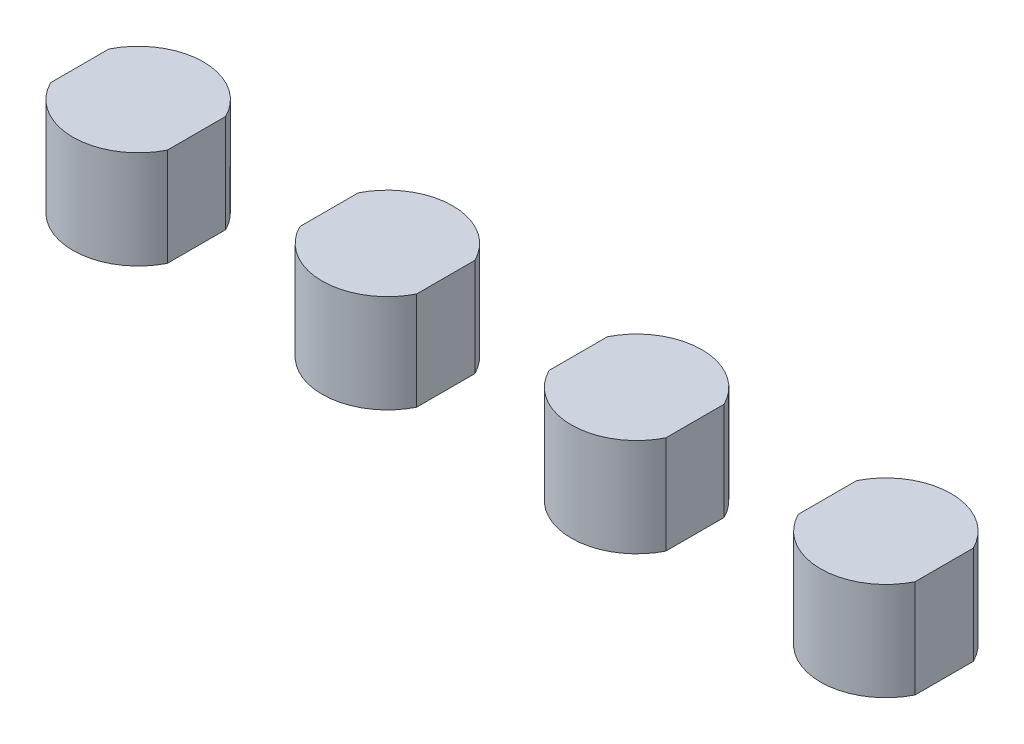
ISO-10303-21;
HEADER;
FILE_DESCRIPTION(('STEP AP214'),'2;1');
FILE_NAME('part.step','',(''),(''),'','','');
FILE_SCHEMA(('AUTOMOTIVE_DESIGN { 1 0 10303 214 1 1 1 1 }'));
ENDSEC;
DATA;
#1=APPLICATION_CONTEXT('core data for automotive mechanical design processes');
#2=APPLICATION_PROTOCOL_DEFINITION('international standard','automotive_design',2000,#1);
#3=PRODUCT_CONTEXT('',#1,'mechanical');
#4=PRODUCT('Part','Part','',(#3));
#5=PRODUCT_RELATED_PRODUCT_CATEGORY('part','',(#4));
#6=PRODUCT_DEFINITION_FORMATION('','',#4);
#7=PRODUCT_DEFINITION_CONTEXT('part definition',#1,'design');
#8=PRODUCT_DEFINITION('design','',#6,#7);
#9=PRODUCT_DEFINITION_SHAPE('','',#8);
#10=(LENGTH_UNIT() NAMED_UNIT(*) SI_UNIT(.MILLI.,.METRE.));
#11=(NAMED_UNIT(*) PLANE_ANGLE_UNIT() SI_UNIT($,.RADIAN.));
#12=(NAMED_UNIT(*) SI_UNIT($,.STERADIAN.) SOLID_ANGLE_UNIT());
#13=UNCERTAINTY_MEASURE_WITH_UNIT(LENGTH_MEASURE(1.E-05),#10,'distance_accuracy_value','');
#14=(GEOMETRIC_REPRESENTATION_CONTEXT(3) GLOBAL_UNCERTAINTY_ASSIGNED_CONTEXT((#13)) GLOBAL_UNIT_ASSIGNED_CONTEXT((#10,
#11,#12)) REPRESENTATION_CONTEXT('',''));
#15=CARTESIAN_POINT('',(0.,0.,0.));
#16=DIRECTION('',(0.,0.,1.));
#17=DIRECTION('',(1.,0.,0.));
#18=AXIS2_PLACEMENT_3D('',#15,#16,#17);
#19=CARTESIAN_POINT('',(40.2657400325711,37.4735453184394,13.7406594232823));
#20=DIRECTION('',(-1.,0.,0.));
#21=DIRECTION('',(0.,0.,1.));
#22=AXIS2_PLACEMENT_3D('',#19,#20,#21);
#23=PLANE('',#22);
#24=DIRECTION('',(0.,0.,-1.));
#25=VECTOR('',#24,1.);
#26=CARTESIAN_POINT('',(40.2657400325711,27.4735453184394,13.7406594232823));
#27=LINE('',#26,#25);
#28=CARTESIAN_POINT('',(40.2657400325711,27.4735453184394,16.7106594232823));
#29=VERTEX_POINT('',#28);
#30=CARTESIAN_POINT('',(40.2657400325711,27.4735453184394,10.7706594232823));
#31=VERTEX_POINT('',#30);
#32=EDGE_CURVE('P0_E77',#29,#31,#27,.T.);
#33=ORIENTED_EDGE('',*,*,#32,.T.);
#34=DIRECTION('',(0.,-1.,0.));
#35=VECTOR('',#34,1.);
#36=CARTESIAN_POINT('',(40.2657400325711,37.4735453184394,10.7706594232823));
#37=LINE('',#36,#35);
#38=CARTESIAN_POINT('',(40.2657400325711,37.4735453184394,10.7706594232823));
#39=VERTEX_POINT('',#38);
#40=EDGE_CURVE('P0_E10',#39,#31,#37,.T.);
#41=ORIENTED_EDGE('',*,*,#40,.F.);
#42=DIRECTION('',(0.,0.,-1.));
#43=VECTOR('',#42,1.);
#44=CARTESIAN_POINT('',(40.2657400325711,37.4735453184394,13.7406594232823));
#45=LINE('',#44,#43);
#46=CARTESIAN_POINT('',(40.2657400325711,37.4735453184394,16.7106594232823));
#47=VERTEX_POINT('',#46);
#48=EDGE_CURVE('P0_E63',#47,#39,#45,.T.);
#49=ORIENTED_EDGE('',*,*,#48,.F.);
#50=DIRECTION('',(0.,-1.,0.));
#51=VECTOR('',#50,1.);
#52=CARTESIAN_POINT('',(40.2657400325711,37.4735453184394,16.7106594232823));
#53=LINE('',#52,#51);
#54=EDGE_CURVE('P0_E74',#47,#29,#53,.T.);
#55=ORIENTED_EDGE('',*,*,#54,.T.);
#56=EDGE_LOOP('',(#33,#41,#49,#55));
#57=FACE_BOUND('',#56,.T.);
#58=ADVANCED_FACE('P0_F16',(#57),#23,.F.);
#59=CARTESIAN_POINT('',(34.3158156633039,37.4735453184394,13.7406594232823));
#60=DIRECTION('',(0.,-1.,0.));
#61=DIRECTION('',(0.,0.,-1.));
#62=AXIS2_PLACEMENT_3D('',#59,#60,#61);
#63=CYLINDRICAL_SURFACE('',#62,6.65);
#64=CARTESIAN_POINT('',(34.3158156633039,27.4735453184394,13.7406594232823));
#65=DIRECTION('',(0.,1.,0.));
#66=DIRECTION('',(0.,0.,1.));
#67=AXIS2_PLACEMENT_3D('',#64,#65,#66);
#68=CIRCLE('',#67,6.65);
#69=CARTESIAN_POINT('',(28.3658912940367,27.4735453184394,10.7706594232823));
#70=VERTEX_POINT('',#69);
#71=EDGE_CURVE('P0_E68',#31,#70,#68,.T.);
#72=ORIENTED_EDGE('',*,*,#71,.T.);
#73=DIRECTION('',(0.,-1.,0.));
#74=VECTOR('',#73,1.);
#75=CARTESIAN_POINT('',(28.3658912940367,37.4735453184394,10.7706594232823));
#76=LINE('',#75,#74);
#77=CARTESIAN_POINT('',(28.3658912940367,37.4735453184394,10.7706594232823));
#78=VERTEX_POINT('',#77);
#79=EDGE_CURVE('P0_E24',#78,#70,#76,.T.);
#80=ORIENTED_EDGE('',*,*,#79,.F.);
#81=CARTESIAN_POINT('',(34.3158156633039,37.4735453184394,13.7406594232823));
#82=DIRECTION('',(0.,1.,0.));
#83=DIRECTION('',(0.,0.,1.));
#84=AXIS2_PLACEMENT_3D('',#81,#82,#83);
#85=CIRCLE('',#84,6.65);
#86=EDGE_CURVE('P0_E58',#39,#78,#85,.T.);
#87=ORIENTED_EDGE('',*,*,#86,.F.);
#88=ORIENTED_EDGE('',*,*,#40,.T.);
#89=EDGE_LOOP('',(#72,#80,#87,#88));
#90=FACE_BOUND('',#89,.T.);
#91=ADVANCED_FACE('P0_F67',(#90),#63,.T.);
#92=CARTESIAN_POINT('',(28.3658912940367,37.4735453184394,13.7406594232823));
#93=DIRECTION('',(-1.,0.,0.));
#94=DIRECTION('',(0.,0.,1.));
#95=AXIS2_PLACEMENT_3D('',#92,#93,#94);
#96=PLANE('',#95);
#97=DIRECTION('',(0.,0.,-1.));
#98=VECTOR('',#97,1.);
#99=CARTESIAN_POINT('',(28.3658912940367,27.4735453184394,13.7406594232823));
#100=LINE('',#99,#98);
#101=CARTESIAN_POINT('',(28.3658912940367,27.4735453184394,16.7106594232823));
#102=VERTEX_POINT('',#101);
#103=EDGE_CURVE('P0_E81',#102,#70,#100,.T.);
#104=ORIENTED_EDGE('',*,*,#103,.F.);
#105=DIRECTION('',(0.,-1.,0.));
#106=VECTOR('',#105,1.);
#107=CARTESIAN_POINT('',(28.3658912940367,37.4735453184394,16.7106594232823));
#108=LINE('',#107,#106);
#109=CARTESIAN_POINT('',(28.3658912940367,37.4735453184394,16.7106594232823));
#110=VERTEX_POINT('',#109);
#111=EDGE_CURVE('P0_E48',#110,#102,#108,.T.);
#112=ORIENTED_EDGE('',*,*,#111,.F.);
#113=DIRECTION('',(0.,0.,-1.));
#114=VECTOR('',#113,1.);
#115=CARTESIAN_POINT('',(28.3658912940367,37.4735453184394,13.7406594232823));
#116=LINE('',#115,#114);
#117=EDGE_CURVE('P0_E61',#110,#78,#116,.T.);
#118=ORIENTED_EDGE('',*,*,#117,.T.);
#119=ORIENTED_EDGE('',*,*,#79,.T.);
#120=EDGE_LOOP('',(#104,#112,#118,#119));
#121=FACE_BOUND('',#120,.T.);
#122=ADVANCED_FACE('P0_F72',(#121),#96,.T.);
#123=EDGE_CURVE('P0_E51',#102,#29,#68,.T.);
#124=ORIENTED_EDGE('',*,*,#123,.T.);
#125=ORIENTED_EDGE('',*,*,#54,.F.);
#126=EDGE_CURVE('P0_E32',#110,#47,#85,.T.);
#127=ORIENTED_EDGE('',*,*,#126,.F.);
#128=ORIENTED_EDGE('',*,*,#111,.T.);
#129=EDGE_LOOP('',(#124,#125,#127,#128));
#130=FACE_BOUND('',#129,.T.);
#131=ADVANCED_FACE('P0_F94',(#130),#63,.T.);
#132=CARTESIAN_POINT('',(34.3158156633039,37.4735453184394,13.7406594232823));
#133=DIRECTION('',(0.,1.,0.));
#134=DIRECTION('',(0.,0.,1.));
#135=AXIS2_PLACEMENT_3D('',#132,#133,#134);
#136=PLANE('',#135);
#137=ORIENTED_EDGE('',*,*,#48,.T.);
#138=ORIENTED_EDGE('',*,*,#86,.T.);
#139=ORIENTED_EDGE('',*,*,#117,.F.);
#140=ORIENTED_EDGE('',*,*,#126,.T.);
#141=EDGE_LOOP('',(#137,#138,#139,#140));
#142=FACE_BOUND('',#141,.T.);
#143=ADVANCED_FACE('P0_F59',(#142),#136,.T.);
#144=CARTESIAN_POINT('',(34.3158156633039,27.4735453184394,13.7406594232823));
#145=DIRECTION('',(0.,1.,0.));
#146=DIRECTION('',(0.,0.,1.));
#147=AXIS2_PLACEMENT_3D('',#144,#145,#146);
#148=PLANE('',#147);
#149=ORIENTED_EDGE('',*,*,#32,.F.);
#150=ORIENTED_EDGE('',*,*,#123,.F.);
#151=ORIENTED_EDGE('',*,*,#103,.T.);
#152=ORIENTED_EDGE('',*,*,#71,.F.);
#153=EDGE_LOOP('',(#149,#150,#151,#152));
#154=FACE_BOUND('',#153,.T.);
#155=ADVANCED_FACE('P0_F87',(#154),#148,.F.);
#156=CLOSED_SHELL('',(#58,#91,#122,#131,#143,#155));
#157=MANIFOLD_SOLID_BREP('P0_B1',#156);
#158=CARTESIAN_POINT('',(2.96589129403669,37.4735453184394,13.7406594232823));
#159=DIRECTION('',(1.,0.,0.));
#160=DIRECTION('',(0.,0.,-1.));
#161=AXIS2_PLACEMENT_3D('',#158,#159,#160);
#162=PLANE('',#161);
#163=DIRECTION('',(0.,0.,1.));
#164=VECTOR('',#163,1.);
#165=CARTESIAN_POINT('',(2.96589129403669,27.4735453184394,13.7406594232823));
#166=LINE('',#165,#164);
#167=CARTESIAN_POINT('',(2.96589129403669,27.4735453184394,10.7706594232823));
#168=VERTEX_POINT('',#167);
#169=CARTESIAN_POINT('',(2.96589129403669,27.4735453184394,16.7106594232823));
#170=VERTEX_POINT('',#169);
#171=EDGE_CURVE('P1_E78',#168,#170,#166,.T.);
#172=ORIENTED_EDGE('',*,*,#171,.T.);
#173=DIRECTION('',(0.,-1.,0.));
#174=VECTOR('',#173,1.);
#175=CARTESIAN_POINT('',(2.96589129403669,37.4735453184394,16.7106594232823));
#176=LINE('',#175,#174);
#177=CARTESIAN_POINT('',(2.96589129403669,37.4735453184394,16.7106594232823));
#178=VERTEX_POINT('',#177);
#179=EDGE_CURVE('P1_E11',#178,#170,#176,.T.);
#180=ORIENTED_EDGE('',*,*,#179,.F.);
#181=DIRECTION('',(0.,0.,1.));
#182=VECTOR('',#181,1.);
#183=CARTESIAN_POINT('',(2.96589129403669,37.4735453184394,13.7406594232823));
#184=LINE('',#183,#182);
#185=CARTESIAN_POINT('',(2.96589129403669,37.4735453184394,10.7706594232823));
#186=VERTEX_POINT('',#185);
#187=EDGE_CURVE('P1_E64',#186,#178,#184,.T.);
#188=ORIENTED_EDGE('',*,*,#187,.F.);
#189=DIRECTION('',(0.,-1.,0.));
#190=VECTOR('',#189,1.);
#191=CARTESIAN_POINT('',(2.96589129403669,37.4735453184394,10.7706594232823));
#192=LINE('',#191,#190);
#193=EDGE_CURVE('P1_E75',#186,#168,#192,.T.);
#194=ORIENTED_EDGE('',*,*,#193,.T.);
#195=EDGE_LOOP('',(#172,#180,#188,#194));
#196=FACE_BOUND('',#195,.T.);
#197=ADVANCED_FACE('P1_F17',(#196),#162,.F.);
#198=CARTESIAN_POINT('',(8.91581566330392,37.4735453184394,13.7406594232823));
#199=DIRECTION('',(0.,-1.,0.));
#200=DIRECTION('',(0.,0.,1.));
#201=AXIS2_PLACEMENT_3D('',#198,#199,#200);
#202=CYLINDRICAL_SURFACE('',#201,6.65);
#203=CARTESIAN_POINT('',(8.91581566330392,27.4735453184394,13.7406594232823));
#204=DIRECTION('',(0.,1.,0.));
#205=DIRECTION('',(0.,0.,-1.));
#206=AXIS2_PLACEMENT_3D('',#203,#204,#205);
#207=CIRCLE('',#206,6.65);
#208=CARTESIAN_POINT('',(14.8657400325711,27.4735453184394,16.7106594232823));
#209=VERTEX_POINT('',#208);
#210=EDGE_CURVE('P1_E69',#170,#209,#207,.T.);
#211=ORIENTED_EDGE('',*,*,#210,.T.);
#212=DIRECTION('',(0.,-1.,0.));
#213=VECTOR('',#212,1.);
#214=CARTESIAN_POINT('',(14.8657400325711,37.4735453184394,16.7106594232823));
#215=LINE('',#214,#213);
#216=CARTESIAN_POINT('',(14.8657400325711,37.4735453184394,16.7106594232823));
#217=VERTEX_POINT('',#216);
#218=EDGE_CURVE('P1_E25',#217,#209,#215,.T.);
#219=ORIENTED_EDGE('',*,*,#218,.F.);
#220=CARTESIAN_POINT('',(8.91581566330392,37.4735453184394,13.7406594232823));
#221=DIRECTION('',(0.,1.,0.));
#222=DIRECTION('',(0.,0.,-1.));
#223=AXIS2_PLACEMENT_3D('',#220,#221,#222);
#224=CIRCLE('',#223,6.65);
#225=EDGE_CURVE('P1_E59',#178,#217,#224,.T.);
#226=ORIENTED_EDGE('',*,*,#225,.F.);
#227=ORIENTED_EDGE('',*,*,#179,.T.);
#228=EDGE_LOOP('',(#211,#219,#226,#227));
#229=FACE_BOUND('',#228,.T.);
#230=ADVANCED_FACE('P1_F68',(#229),#202,.T.);
#231=CARTESIAN_POINT('',(14.8657400325711,37.4735453184394,13.7406594232823));
#232=DIRECTION('',(1.,0.,0.));
#233=DIRECTION('',(0.,0.,-1.));
#234=AXIS2_PLACEMENT_3D('',#231,#232,#233);
#235=PLANE('',#234);
#236=DIRECTION('',(0.,0.,1.));
#237=VECTOR('',#236,1.);
#238=CARTESIAN_POINT('',(14.8657400325711,27.4735453184394,13.7406594232823));
#239=LINE('',#238,#237);
#240=CARTESIAN_POINT('',(14.8657400325711,27.4735453184394,10.7706594232823));
#241=VERTEX_POINT('',#240);
#242=EDGE_CURVE('P1_E82',#241,#209,#239,.T.);
#243=ORIENTED_EDGE('',*,*,#242,.F.);
#244=DIRECTION('',(0.,-1.,0.));
#245=VECTOR('',#244,1.);
#246=CARTESIAN_POINT('',(14.8657400325711,37.4735453184394,10.7706594232823));
#247=LINE('',#246,#245);
#248=CARTESIAN_POINT('',(14.8657400325711,37.4735453184394,10.7706594232823));
#249=VERTEX_POINT('',#248);
#250=EDGE_CURVE('P1_E49',#249,#241,#247,.T.);
#251=ORIENTED_EDGE('',*,*,#250,.F.);
#252=DIRECTION('',(0.,0.,1.));
#253=VECTOR('',#252,1.);
#254=CARTESIAN_POINT('',(14.8657400325711,37.4735453184394,13.7406594232823));
#255=LINE('',#254,#253);
#256=EDGE_CURVE('P1_E62',#249,#217,#255,.T.);
#257=ORIENTED_EDGE('',*,*,#256,.T.);
#258=ORIENTED_EDGE('',*,*,#218,.T.);
#259=EDGE_LOOP('',(#243,#251,#257,#258));
#260=FACE_BOUND('',#259,.T.);
#261=ADVANCED_FACE('P1_F73',(#260),#235,.T.);
#262=EDGE_CURVE('P1_E52',#241,#168,#207,.T.);
#263=ORIENTED_EDGE('',*,*,#262,.T.);
#264=ORIENTED_EDGE('',*,*,#193,.F.);
#265=EDGE_CURVE('P1_E33',#249,#186,#224,.T.);
#266=ORIENTED_EDGE('',*,*,#265,.F.);
#267=ORIENTED_EDGE('',*,*,#250,.T.);
#268=EDGE_LOOP('',(#263,#264,#266,#267));
#269=FACE_BOUND('',#268,.T.);
#270=ADVANCED_FACE('P1_F95',(#269),#202,.T.);
#271=CARTESIAN_POINT('',(8.91581566330392,37.4735453184394,13.7406594232823));
#272=DIRECTION('',(0.,1.,0.));
#273=DIRECTION('',(0.,0.,-1.));
#274=AXIS2_PLACEMENT_3D('',#271,#272,#273);
#275=PLANE('',#274);
#276=ORIENTED_EDGE('',*,*,#187,.T.);
#277=ORIENTED_EDGE('',*,*,#225,.T.);
#278=ORIENTED_EDGE('',*,*,#256,.F.);
#279=ORIENTED_EDGE('',*,*,#265,.T.);
#280=EDGE_LOOP('',(#276,#277,#278,#279));
#281=FACE_BOUND('',#280,.T.);
#282=ADVANCED_FACE('P1_F60',(#281),#275,.T.);
#283=CARTESIAN_POINT('',(8.91581566330392,27.4735453184394,13.7406594232823));
#284=DIRECTION('',(0.,1.,0.));
#285=DIRECTION('',(0.,0.,-1.));
#286=AXIS2_PLACEMENT_3D('',#283,#284,#285);
#287=PLANE('',#286);
#288=ORIENTED_EDGE('',*,*,#171,.F.);
#289=ORIENTED_EDGE('',*,*,#262,.F.);
#290=ORIENTED_EDGE('',*,*,#242,.T.);
#291=ORIENTED_EDGE('',*,*,#210,.F.);
#292=EDGE_LOOP('',(#288,#289,#290,#291));
#293=FACE_BOUND('',#292,.T.);
#294=ADVANCED_FACE('P1_F88',(#293),#287,.F.);
#295=CLOSED_SHELL('',(#197,#230,#261,#270,#282,#294));
#296=MANIFOLD_SOLID_BREP('P1_B1',#295);
#297=CARTESIAN_POINT('',(-35.9342599674289,37.4735453184394,13.7406594232823));
#298=DIRECTION('',(-1.,0.,0.));
#299=DIRECTION('',(0.,0.,1.));
#300=AXIS2_PLACEMENT_3D('',#297,#298,#299);
#301=PLANE('',#300);
#302=DIRECTION('',(0.,0.,-1.));
#303=VECTOR('',#302,1.);
#304=CARTESIAN_POINT('',(-35.9342599674289,27.4735453184394,13.7406594232823));
#305=LINE('',#304,#303);
#306=CARTESIAN_POINT('',(-35.9342599674289,27.4735453184394,16.7106594232823));
#307=VERTEX_POINT('',#306);
#308=CARTESIAN_POINT('',(-35.9342599674289,27.4735453184394,10.7706594232823));
#309=VERTEX_POINT('',#308);
#310=EDGE_CURVE('P2_E78',#307,#309,#305,.T.);
#311=ORIENTED_EDGE('',*,*,#310,.T.);
#312=DIRECTION('',(0.,-1.,0.));
#313=VECTOR('',#312,1.);
#314=CARTESIAN_POINT('',(-35.9342599674289,37.4735453184394,10.7706594232823));
#315=LINE('',#314,#313);
#316=CARTESIAN_POINT('',(-35.9342599674289,37.4735453184394,10.7706594232823));
#317=VERTEX_POINT('',#316);
#318=EDGE_CURVE('P2_E11',#317,#309,#315,.T.);
#319=ORIENTED_EDGE('',*,*,#318,.F.);
#320=DIRECTION('',(0.,0.,-1.));
#321=VECTOR('',#320,1.);
#322=CARTESIAN_POINT('',(-35.9342599674289,37.4735453184394,13.7406594232823));
#323=LINE('',#322,#321);
#324=CARTESIAN_POINT('',(-35.9342599674289,37.4735453184394,16.7106594232823));
#325=VERTEX_POINT('',#324);
#326=EDGE_CURVE('P2_E64',#325,#317,#323,.T.);
#327=ORIENTED_EDGE('',*,*,#326,.F.);
#328=DIRECTION('',(0.,-1.,0.));
#329=VECTOR('',#328,1.);
#330=CARTESIAN_POINT('',(-35.9342599674289,37.4735453184394,16.7106594232823));
#331=LINE('',#330,#329);
#332=EDGE_CURVE('P2_E75',#325,#307,#331,.T.);
#333=ORIENTED_EDGE('',*,*,#332,.T.);
#334=EDGE_LOOP('',(#311,#319,#327,#333));
#335=FACE_BOUND('',#334,.T.);
#336=ADVANCED_FACE('P2_F17',(#335),#301,.F.);
#337=CARTESIAN_POINT('',(-41.8841843366961,37.4735453184394,13.7406594232823));
#338=DIRECTION('',(0.,-1.,0.));
#339=DIRECTION('',(0.,0.,-1.));
#340=AXIS2_PLACEMENT_3D('',#337,#338,#339);
#341=CYLINDRICAL_SURFACE('',#340,6.65);
#342=CARTESIAN_POINT('',(-41.8841843366961,27.4735453184394,13.7406594232823));
#343=DIRECTION('',(0.,1.,0.));
#344=DIRECTION('',(0.,0.,1.));
#345=AXIS2_PLACEMENT_3D('',#342,#343,#344);
#346=CIRCLE('',#345,6.65);
#347=CARTESIAN_POINT('',(-47.8341087059633,27.4735453184394,10.7706594232823));
#348=VERTEX_POINT('',#347);
#349=EDGE_CURVE('P2_E69',#309,#348,#346,.T.);
#350=ORIENTED_EDGE('',*,*,#349,.T.);
#351=DIRECTION('',(0.,-1.,0.));
#352=VECTOR('',#351,1.);
#353=CARTESIAN_POINT('',(-47.8341087059633,37.4735453184394,10.7706594232823));
#354=LINE('',#353,#352);
#355=CARTESIAN_POINT('',(-47.8341087059633,37.4735453184394,10.7706594232823));
#356=VERTEX_POINT('',#355);
#357=EDGE_CURVE('P2_E25',#356,#348,#354,.T.);
#358=ORIENTED_EDGE('',*,*,#357,.F.);
#359=CARTESIAN_POINT('',(-41.8841843366961,37.4735453184394,13.7406594232823));
#360=DIRECTION('',(0.,1.,0.));
#361=DIRECTION('',(0.,0.,1.));
#362=AXIS2_PLACEMENT_3D('',#359,#360,#361);
#363=CIRCLE('',#362,6.65);
#364=EDGE_CURVE('P2_E59',#317,#356,#363,.T.);
#365=ORIENTED_EDGE('',*,*,#364,.F.);
#366=ORIENTED_EDGE('',*,*,#318,.T.);
#367=EDGE_LOOP('',(#350,#358,#365,#366));
#368=FACE_BOUND('',#367,.T.);
#369=ADVANCED_FACE('P2_F68',(#368),#341,.T.);
#370=CARTESIAN_POINT('',(-47.8341087059633,37.4735453184394,13.7406594232823));
#371=DIRECTION('',(-1.,0.,0.));
#372=DIRECTION('',(0.,0.,1.));
#373=AXIS2_PLACEMENT_3D('',#370,#371,#372);
#374=PLANE('',#373);
#375=DIRECTION('',(0.,0.,-1.));
#376=VECTOR('',#375,1.);
#377=CARTESIAN_POINT('',(-47.8341087059633,27.4735453184394,13.7406594232823));
#378=LINE('',#377,#376);
#379=CARTESIAN_POINT('',(-47.8341087059633,27.4735453184394,16.7106594232823));
#380=VERTEX_POINT('',#379);
#381=EDGE_CURVE('P2_E82',#380,#348,#378,.T.);
#382=ORIENTED_EDGE('',*,*,#381,.F.);
#383=DIRECTION('',(0.,-1.,0.));
#384=VECTOR('',#383,1.);
#385=CARTESIAN_POINT('',(-47.8341087059633,37.4735453184394,16.7106594232823));
#386=LINE('',#385,#384);
#387=CARTESIAN_POINT('',(-47.8341087059633,37.4735453184394,16.7106594232823));
#388=VERTEX_POINT('',#387);
#389=EDGE_CURVE('P2_E49',#388,#380,#386,.T.);
#390=ORIENTED_EDGE('',*,*,#389,.F.);
#391=DIRECTION('',(0.,0.,-1.));
#392=VECTOR('',#391,1.);
#393=CARTESIAN_POINT('',(-47.8341087059633,37.4735453184394,13.7406594232823));
#394=LINE('',#393,#392);
#395=EDGE_CURVE('P2_E62',#388,#356,#394,.T.);
#396=ORIENTED_EDGE('',*,*,#395,.T.);
#397=ORIENTED_EDGE('',*,*,#357,.T.);
#398=EDGE_LOOP('',(#382,#390,#396,#397));
#399=FACE_BOUND('',#398,.T.);
#400=ADVANCED_FACE('P2_F73',(#399),#374,.T.);
#401=EDGE_CURVE('P2_E52',#380,#307,#346,.T.);
#402=ORIENTED_EDGE('',*,*,#401,.T.);
#403=ORIENTED_EDGE('',*,*,#332,.F.);
#404=EDGE_CURVE('P2_E33',#388,#325,#363,.T.);
#405=ORIENTED_EDGE('',*,*,#404,.F.);
#406=ORIENTED_EDGE('',*,*,#389,.T.);
#407=EDGE_LOOP('',(#402,#403,#405,#406));
#408=FACE_BOUND('',#407,.T.);
#409=ADVANCED_FACE('P2_F95',(#408),#341,.T.);
#410=CARTESIAN_POINT('',(-41.8841843366961,37.4735453184394,13.7406594232823));
#411=DIRECTION('',(0.,1.,0.));
#412=DIRECTION('',(0.,0.,1.));
#413=AXIS2_PLACEMENT_3D('',#410,#411,#412);
#414=PLANE('',#413);
#415=ORIENTED_EDGE('',*,*,#326,.T.);
#416=ORIENTED_EDGE('',*,*,#364,.T.);
#417=ORIENTED_EDGE('',*,*,#395,.F.);
#418=ORIENTED_EDGE('',*,*,#404,.T.);
#419=EDGE_LOOP('',(#415,#416,#417,#418));
#420=FACE_BOUND('',#419,.T.);
#421=ADVANCED_FACE('P2_F60',(#420),#414,.T.);
#422=CARTESIAN_POINT('',(-41.8841843366961,27.4735453184394,13.7406594232823));
#423=DIRECTION('',(0.,1.,0.));
#424=DIRECTION('',(0.,0.,1.));
#425=AXIS2_PLACEMENT_3D('',#422,#423,#424);
#426=PLANE('',#425);
#427=ORIENTED_EDGE('',*,*,#310,.F.);
#428=ORIENTED_EDGE('',*,*,#401,.F.);
#429=ORIENTED_EDGE('',*,*,#381,.T.);
#430=ORIENTED_EDGE('',*,*,#349,.F.);
#431=EDGE_LOOP('',(#427,#428,#429,#430));
#432=FACE_BOUND('',#431,.T.);
#433=ADVANCED_FACE('P2_F88',(#432),#426,.F.);
#434=CLOSED_SHELL('',(#336,#369,#400,#409,#421,#433));
#435=MANIFOLD_SOLID_BREP('P2_B1',#434);
#436=CARTESIAN_POINT('',(-10.5342599674289,37.4735453184394,13.7406594232823));
#437=DIRECTION('',(-1.,0.,0.));
#438=DIRECTION('',(0.,0.,1.));
#439=AXIS2_PLACEMENT_3D('',#436,#437,#438);
#440=PLANE('',#439);
#441=DIRECTION('',(0.,0.,-1.));
#442=VECTOR('',#441,1.);
#443=CARTESIAN_POINT('',(-10.5342599674289,27.4735453184394,13.7406594232823));
#444=LINE('',#443,#442);
#445=CARTESIAN_POINT('',(-10.5342599674289,27.4735453184394,16.7106594232823));
#446=VERTEX_POINT('',#445);
#447=CARTESIAN_POINT('',(-10.5342599674289,27.4735453184394,10.7706594232823));
#448=VERTEX_POINT('',#447);
#449=EDGE_CURVE('P3_E78',#446,#448,#444,.T.);
#450=ORIENTED_EDGE('',*,*,#449,.T.);
#451=DIRECTION('',(0.,-1.,0.));
#452=VECTOR('',#451,1.);
#453=CARTESIAN_POINT('',(-10.5342599674289,37.4735453184394,10.7706594232823));
#454=LINE('',#453,#452);
#455=CARTESIAN_POINT('',(-10.5342599674289,37.4735453184394,10.7706594232823));
#456=VERTEX_POINT('',#455);
#457=EDGE_CURVE('P3_E11',#456,#448,#454,.T.);
#458=ORIENTED_EDGE('',*,*,#457,.F.);
#459=DIRECTION('',(0.,0.,-1.));
#460=VECTOR('',#459,1.);
#461=CARTESIAN_POINT('',(-10.5342599674289,37.4735453184394,13.7406594232823));
#462=LINE('',#461,#460);
#463=CARTESIAN_POINT('',(-10.5342599674289,37.4735453184394,16.7106594232823));
#464=VERTEX_POINT('',#463);
#465=EDGE_CURVE('P3_E64',#464,#456,#462,.T.);
#466=ORIENTED_EDGE('',*,*,#465,.F.);
#467=DIRECTION('',(0.,-1.,0.));
#468=VECTOR('',#467,1.);
#469=CARTESIAN_POINT('',(-10.5342599674289,37.4735453184394,16.7106594232823));
#470=LINE('',#469,#468);
#471=EDGE_CURVE('P3_E75',#464,#446,#470,.T.);
#472=ORIENTED_EDGE('',*,*,#471,.T.);
#473=EDGE_LOOP('',(#450,#458,#466,#472));
#474=FACE_BOUND('',#473,.T.);
#475=ADVANCED_FACE('P3_F17',(#474),#440,.F.);
#476=CARTESIAN_POINT('',(-16.4841843366961,37.4735453184394,13.7406594232823));
#477=DIRECTION('',(0.,-1.,0.));
#478=DIRECTION('',(0.,0.,-1.));
#479=AXIS2_PLACEMENT_3D('',#476,#477,#478);
#480=CYLINDRICAL_SURFACE('',#479,6.65);
#481=CARTESIAN_POINT('',(-16.4841843366961,27.4735453184394,13.7406594232823));
#482=DIRECTION('',(0.,1.,0.));
#483=DIRECTION('',(0.,0.,1.));
#484=AXIS2_PLACEMENT_3D('',#481,#482,#483);
#485=CIRCLE('',#484,6.65);
#486=CARTESIAN_POINT('',(-22.4341087059633,27.4735453184394,10.7706594232823));
#487=VERTEX_POINT('',#486);
#488=EDGE_CURVE('P3_E69',#448,#487,#485,.T.);
#489=ORIENTED_EDGE('',*,*,#488,.T.);
#490=DIRECTION('',(0.,-1.,0.));
#491=VECTOR('',#490,1.);
#492=CARTESIAN_POINT('',(-22.4341087059633,37.4735453184394,10.7706594232823));
#493=LINE('',#492,#491);
#494=CARTESIAN_POINT('',(-22.4341087059633,37.4735453184394,10.7706594232823));
#495=VERTEX_POINT('',#494);
#496=EDGE_CURVE('P3_E25',#495,#487,#493,.T.);
#497=ORIENTED_EDGE('',*,*,#496,.F.);
#498=CARTESIAN_POINT('',(-16.4841843366961,37.4735453184394,13.7406594232823));
#499=DIRECTION('',(0.,1.,0.));
#500=DIRECTION('',(0.,0.,1.));
#501=AXIS2_PLACEMENT_3D('',#498,#499,#500);
#502=CIRCLE('',#501,6.65);
#503=EDGE_CURVE('P3_E59',#456,#495,#502,.T.);
#504=ORIENTED_EDGE('',*,*,#503,.F.);
#505=ORIENTED_EDGE('',*,*,#457,.T.);
#506=EDGE_LOOP('',(#489,#497,#504,#505));
#507=FACE_BOUND('',#506,.T.);
#508=ADVANCED_FACE('P3_F68',(#507),#480,.T.);
#509=CARTESIAN_POINT('',(-22.4341087059633,37.4735453184394,13.7406594232823));
#510=DIRECTION('',(-1.,0.,0.));
#511=DIRECTION('',(0.,0.,1.));
#512=AXIS2_PLACEMENT_3D('',#509,#510,#511);
#513=PLANE('',#512);
#514=DIRECTION('',(0.,0.,-1.));
#515=VECTOR('',#514,1.);
#516=CARTESIAN_POINT('',(-22.4341087059633,27.4735453184394,13.7406594232823));
#517=LINE('',#516,#515);
#518=CARTESIAN_POINT('',(-22.4341087059633,27.4735453184394,16.7106594232823));
#519=VERTEX_POINT('',#518);
#520=EDGE_CURVE('P3_E82',#519,#487,#517,.T.);
#521=ORIENTED_EDGE('',*,*,#520,.F.);
#522=DIRECTION('',(0.,-1.,0.));
#523=VECTOR('',#522,1.);
#524=CARTESIAN_POINT('',(-22.4341087059633,37.4735453184394,16.7106594232823));
#525=LINE('',#524,#523);
#526=CARTESIAN_POINT('',(-22.4341087059633,37.4735453184394,16.7106594232823));
#527=VERTEX_POINT('',#526);
#528=EDGE_CURVE('P3_E49',#527,#519,#525,.T.);
#529=ORIENTED_EDGE('',*,*,#528,.F.);
#530=DIRECTION('',(0.,0.,-1.));
#531=VECTOR('',#530,1.);
#532=CARTESIAN_POINT('',(-22.4341087059633,37.4735453184394,13.7406594232823));
#533=LINE('',#532,#531);
#534=EDGE_CURVE('P3_E62',#527,#495,#533,.T.);
#535=ORIENTED_EDGE('',*,*,#534,.T.);
#536=ORIENTED_EDGE('',*,*,#496,.T.);
#537=EDGE_LOOP('',(#521,#529,#535,#536));
#538=FACE_BOUND('',#537,.T.);
#539=ADVANCED_FACE('P3_F73',(#538),#513,.T.);
#540=EDGE_CURVE('P3_E52',#519,#446,#485,.T.);
#541=ORIENTED_EDGE('',*,*,#540,.T.);
#542=ORIENTED_EDGE('',*,*,#471,.F.);
#543=EDGE_CURVE('P3_E33',#527,#464,#502,.T.);
#544=ORIENTED_EDGE('',*,*,#543,.F.);
#545=ORIENTED_EDGE('',*,*,#528,.T.);
#546=EDGE_LOOP('',(#541,#542,#544,#545));
#547=FACE_BOUND('',#546,.T.);
#548=ADVANCED_FACE('P3_F95',(#547),#480,.T.);
#549=CARTESIAN_POINT('',(-16.4841843366961,37.4735453184394,13.7406594232823));
#550=DIRECTION('',(0.,1.,0.));
#551=DIRECTION('',(0.,0.,1.));
#552=AXIS2_PLACEMENT_3D('',#549,#550,#551);
#553=PLANE('',#552);
#554=ORIENTED_EDGE('',*,*,#465,.T.);
#555=ORIENTED_EDGE('',*,*,#503,.T.);
#556=ORIENTED_EDGE('',*,*,#534,.F.);
#557=ORIENTED_EDGE('',*,*,#543,.T.);
#558=EDGE_LOOP('',(#554,#555,#556,#557));
#559=FACE_BOUND('',#558,.T.);
#560=ADVANCED_FACE('P3_F60',(#559),#553,.T.);
#561=CARTESIAN_POINT('',(-16.4841843366961,27.4735453184394,13.7406594232823));
#562=DIRECTION('',(0.,1.,0.));
#563=DIRECTION('',(0.,0.,1.));
#564=AXIS2_PLACEMENT_3D('',#561,#562,#563);
#565=PLANE('',#564);
#566=ORIENTED_EDGE('',*,*,#449,.F.);
#567=ORIENTED_EDGE('',*,*,#540,.F.);
#568=ORIENTED_EDGE('',*,*,#520,.T.);
#569=ORIENTED_EDGE('',*,*,#488,.F.);
#570=EDGE_LOOP('',(#566,#567,#568,#569));
#571=FACE_BOUND('',#570,.T.);
#572=ADVANCED_FACE('P3_F88',(#571),#565,.F.);
#573=CLOSED_SHELL('',(#475,#508,#539,#548,#560,#572));
#574=MANIFOLD_SOLID_BREP('P3_B1',#573);
#575=ADVANCED_BREP_SHAPE_REPRESENTATION('',(#18,#157,#296,#435,#574),#14);
#576=SHAPE_DEFINITION_REPRESENTATION(#9,#575);
ENDSEC;
END-ISO-10303-21;
